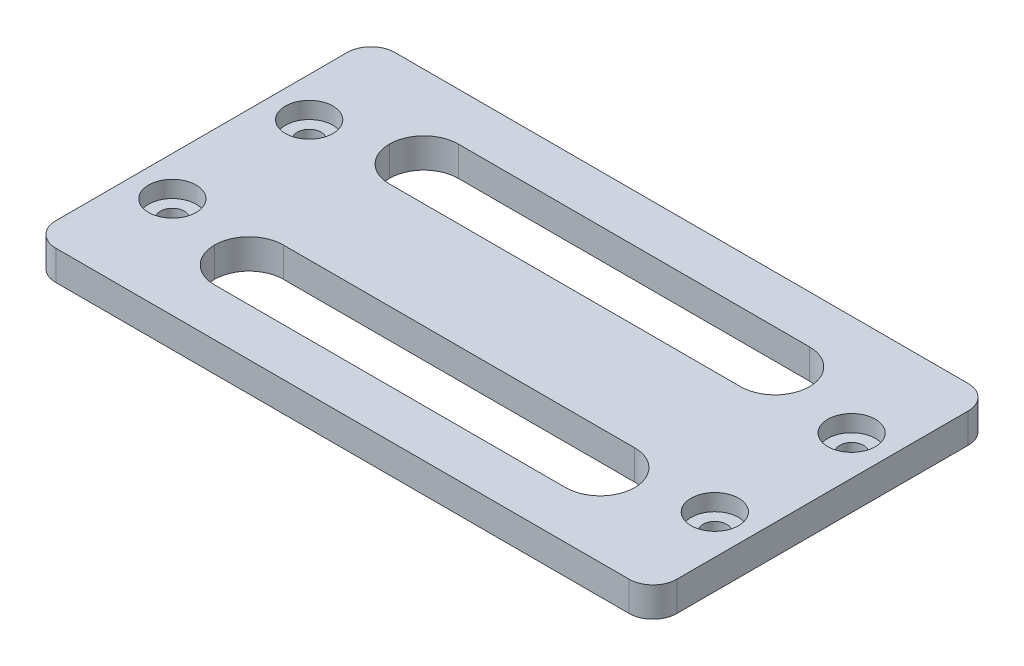
ISO-10303-21;
HEADER;
FILE_DESCRIPTION(('STEP AP214'),'2;1');
FILE_NAME('part.step','',(''),(''),'','','');
FILE_SCHEMA(('AUTOMOTIVE_DESIGN { 1 0 10303 214 1 1 1 1 }'));
ENDSEC;
DATA;
#1=APPLICATION_CONTEXT('core data for automotive mechanical design processes');
#2=APPLICATION_PROTOCOL_DEFINITION('international standard','automotive_design',2000,#1);
#3=PRODUCT_CONTEXT('',#1,'mechanical');
#4=PRODUCT('Part','Part','',(#3));
#5=PRODUCT_RELATED_PRODUCT_CATEGORY('part','',(#4));
#6=PRODUCT_DEFINITION_FORMATION('','',#4);
#7=PRODUCT_DEFINITION_CONTEXT('part definition',#1,'design');
#8=PRODUCT_DEFINITION('design','',#6,#7);
#9=PRODUCT_DEFINITION_SHAPE('','',#8);
#10=(LENGTH_UNIT() NAMED_UNIT(*) SI_UNIT(.MILLI.,.METRE.));
#11=(NAMED_UNIT(*) PLANE_ANGLE_UNIT() SI_UNIT($,.RADIAN.));
#12=(NAMED_UNIT(*) SI_UNIT($,.STERADIAN.) SOLID_ANGLE_UNIT());
#13=UNCERTAINTY_MEASURE_WITH_UNIT(LENGTH_MEASURE(1.E-05),#10,'distance_accuracy_value','');
#14=(GEOMETRIC_REPRESENTATION_CONTEXT(3) GLOBAL_UNCERTAINTY_ASSIGNED_CONTEXT((#13)) GLOBAL_UNIT_ASSIGNED_CONTEXT((#10,
#11,#12)) REPRESENTATION_CONTEXT('',''));
#15=CARTESIAN_POINT('',(0.,0.,0.));
#16=DIRECTION('',(0.,0.,1.));
#17=DIRECTION('',(1.,0.,0.));
#18=AXIS2_PLACEMENT_3D('',#15,#16,#17);
#19=CARTESIAN_POINT('',(22.8,2.5,-8.3));
#20=DIRECTION('',(0.,-1.,0.));
#21=DIRECTION('',(0.,0.,-1.));
#22=AXIS2_PLACEMENT_3D('',#19,#20,#21);
#23=CYLINDRICAL_SURFACE('',#22,1.);
#24=CARTESIAN_POINT('',(22.8,0.,-8.3));
#25=DIRECTION('',(0.,1.,0.));
#26=DIRECTION('',(0.,0.,1.));
#27=AXIS2_PLACEMENT_3D('',#24,#25,#26);
#28=CIRCLE('',#27,1.);
#29=CARTESIAN_POINT('',(22.8,0.,-7.29999999999999));
#30=VERTEX_POINT('',#29);
#31=EDGE_CURVE('E358',#30,#30,#28,.T.);
#32=ORIENTED_EDGE('',*,*,#31,.F.);
#33=EDGE_LOOP('',(#32));
#34=FACE_BOUND('',#33,.T.);
#35=CARTESIAN_POINT('',(22.8,1.1,-8.3));
#36=DIRECTION('',(0.,1.,0.));
#37=DIRECTION('',(0.,0.,1.));
#38=AXIS2_PLACEMENT_3D('',#35,#36,#37);
#39=CIRCLE('',#38,1.);
#40=CARTESIAN_POINT('',(22.8,1.1,-7.29999999999999));
#41=VERTEX_POINT('',#40);
#42=EDGE_CURVE('E38',#41,#41,#39,.T.);
#43=ORIENTED_EDGE('',*,*,#42,.T.);
#44=EDGE_LOOP('',(#43));
#45=FACE_BOUND('',#44,.T.);
#46=ADVANCED_FACE('F34',(#34,#45),#23,.F.);
#47=CARTESIAN_POINT('',(22.8,2.5,3.2));
#48=DIRECTION('',(0.,-1.,0.));
#49=DIRECTION('',(0.,0.,-1.));
#50=AXIS2_PLACEMENT_3D('',#47,#48,#49);
#51=CYLINDRICAL_SURFACE('',#50,1.);
#52=CARTESIAN_POINT('',(22.8,0.,3.2));
#53=DIRECTION('',(0.,1.,0.));
#54=DIRECTION('',(0.,0.,-1.));
#55=AXIS2_PLACEMENT_3D('',#52,#53,#54);
#56=CIRCLE('',#55,1.);
#57=CARTESIAN_POINT('',(22.8,0.,2.19999999999999));
#58=VERTEX_POINT('',#57);
#59=EDGE_CURVE('E361',#58,#58,#56,.T.);
#60=ORIENTED_EDGE('',*,*,#59,.F.);
#61=EDGE_LOOP('',(#60));
#62=FACE_BOUND('',#61,.T.);
#63=CARTESIAN_POINT('',(22.8,1.1,3.2));
#64=DIRECTION('',(0.,1.,0.));
#65=DIRECTION('',(0.,0.,1.));
#66=AXIS2_PLACEMENT_3D('',#63,#64,#65);
#67=CIRCLE('',#66,1.);
#68=CARTESIAN_POINT('',(22.8,1.1,4.2));
#69=VERTEX_POINT('',#68);
#70=EDGE_CURVE('E308',#69,#69,#67,.T.);
#71=ORIENTED_EDGE('',*,*,#70,.T.);
#72=EDGE_LOOP('',(#71));
#73=FACE_BOUND('',#72,.T.);
#74=ADVANCED_FACE('F412',(#62,#73),#51,.F.);
#75=CARTESIAN_POINT('',(-22.8,2.5,3.2));
#76=DIRECTION('',(0.,-1.,0.));
#77=DIRECTION('',(0.,0.,-1.));
#78=AXIS2_PLACEMENT_3D('',#75,#76,#77);
#79=CYLINDRICAL_SURFACE('',#78,1.);
#80=CARTESIAN_POINT('',(-22.8,0.,3.2));
#81=DIRECTION('',(0.,1.,0.));
#82=DIRECTION('',(0.,0.,1.));
#83=AXIS2_PLACEMENT_3D('',#80,#81,#82);
#84=CIRCLE('',#83,1.);
#85=CARTESIAN_POINT('',(-22.8,0.,4.2));
#86=VERTEX_POINT('',#85);
#87=EDGE_CURVE('E205',#86,#86,#84,.T.);
#88=ORIENTED_EDGE('',*,*,#87,.F.);
#89=EDGE_LOOP('',(#88));
#90=FACE_BOUND('',#89,.T.);
#91=CARTESIAN_POINT('',(-22.8,1.1,3.2));
#92=DIRECTION('',(0.,1.,0.));
#93=DIRECTION('',(0.,0.,1.));
#94=AXIS2_PLACEMENT_3D('',#91,#92,#93);
#95=CIRCLE('',#94,1.);
#96=CARTESIAN_POINT('',(-22.8,1.1,4.2));
#97=VERTEX_POINT('',#96);
#98=EDGE_CURVE('E304',#97,#97,#95,.T.);
#99=ORIENTED_EDGE('',*,*,#98,.T.);
#100=EDGE_LOOP('',(#99));
#101=FACE_BOUND('',#100,.T.);
#102=ADVANCED_FACE('F418',(#90,#101),#79,.F.);
#103=CARTESIAN_POINT('',(-22.8,2.5,-8.29999999999999));
#104=DIRECTION('',(0.,-1.,0.));
#105=DIRECTION('',(0.,0.,-1.));
#106=AXIS2_PLACEMENT_3D('',#103,#104,#105);
#107=CYLINDRICAL_SURFACE('',#106,1.);
#108=CARTESIAN_POINT('',(-22.8,0.,-8.29999999999999));
#109=DIRECTION('',(0.,1.,0.));
#110=DIRECTION('',(0.,0.,-1.));
#111=AXIS2_PLACEMENT_3D('',#108,#109,#110);
#112=CIRCLE('',#111,1.);
#113=CARTESIAN_POINT('',(-22.8,0.,-9.29999999999999));
#114=VERTEX_POINT('',#113);
#115=EDGE_CURVE('E352',#114,#114,#112,.T.);
#116=ORIENTED_EDGE('',*,*,#115,.F.);
#117=EDGE_LOOP('',(#116));
#118=FACE_BOUND('',#117,.T.);
#119=CARTESIAN_POINT('',(-22.8,1.1,-8.29999999999999));
#120=DIRECTION('',(0.,1.,0.));
#121=DIRECTION('',(0.,0.,1.));
#122=AXIS2_PLACEMENT_3D('',#119,#120,#121);
#123=CIRCLE('',#122,1.);
#124=CARTESIAN_POINT('',(-22.8,1.1,-7.29999999999999));
#125=VERTEX_POINT('',#124);
#126=EDGE_CURVE('E300',#125,#125,#123,.T.);
#127=ORIENTED_EDGE('',*,*,#126,.T.);
#128=EDGE_LOOP('',(#127));
#129=FACE_BOUND('',#128,.T.);
#130=ADVANCED_FACE('F424',(#118,#129),#107,.F.);
#131=CARTESIAN_POINT('',(0.,2.5,0.));
#132=DIRECTION('',(0.,-1.,0.));
#133=DIRECTION('',(0.,0.,-1.));
#134=AXIS2_PLACEMENT_3D('',#131,#132,#133);
#135=PLANE('',#134);
#136=CARTESIAN_POINT('',(22.8,2.5,-8.3));
#137=DIRECTION('',(0.,1.,0.));
#138=DIRECTION('',(0.,0.,1.));
#139=AXIS2_PLACEMENT_3D('',#136,#137,#138);
#140=CIRCLE('',#139,2.);
#141=CARTESIAN_POINT('',(22.8,2.5,-6.29999999999999));
#142=VERTEX_POINT('',#141);
#143=EDGE_CURVE('E324',#142,#142,#140,.T.);
#144=ORIENTED_EDGE('',*,*,#143,.F.);
#145=EDGE_LOOP('',(#144));
#146=FACE_BOUND('',#145,.T.);
#147=CARTESIAN_POINT('',(22.8,2.5,3.2));
#148=DIRECTION('',(0.,1.,0.));
#149=DIRECTION('',(0.,0.,1.));
#150=AXIS2_PLACEMENT_3D('',#147,#148,#149);
#151=CIRCLE('',#150,2.);
#152=CARTESIAN_POINT('',(22.8,2.5,5.2));
#153=VERTEX_POINT('',#152);
#154=EDGE_CURVE('E317',#153,#153,#151,.T.);
#155=ORIENTED_EDGE('',*,*,#154,.F.);
#156=EDGE_LOOP('',(#155));
#157=FACE_BOUND('',#156,.T.);
#158=CARTESIAN_POINT('',(-22.8,2.5,3.2));
#159=DIRECTION('',(0.,1.,0.));
#160=DIRECTION('',(0.,0.,1.));
#161=AXIS2_PLACEMENT_3D('',#158,#159,#160);
#162=CIRCLE('',#161,2.);
#163=CARTESIAN_POINT('',(-22.8,2.5,5.2));
#164=VERTEX_POINT('',#163);
#165=EDGE_CURVE('E310',#164,#164,#162,.T.);
#166=ORIENTED_EDGE('',*,*,#165,.F.);
#167=EDGE_LOOP('',(#166));
#168=FACE_BOUND('',#167,.T.);
#169=CARTESIAN_POINT('',(-22.8,2.5,-8.29999999999999));
#170=DIRECTION('',(0.,1.,0.));
#171=DIRECTION('',(0.,0.,1.));
#172=AXIS2_PLACEMENT_3D('',#169,#170,#171);
#173=CIRCLE('',#172,2.);
#174=CARTESIAN_POINT('',(-22.8,2.5,-6.29999999999999));
#175=VERTEX_POINT('',#174);
#176=EDGE_CURVE('E306',#175,#175,#173,.T.);
#177=ORIENTED_EDGE('',*,*,#176,.F.);
#178=EDGE_LOOP('',(#177));
#179=FACE_BOUND('',#178,.T.);
#180=DIRECTION('',(-1.,0.,0.));
#181=VECTOR('',#180,1.);
#182=CARTESIAN_POINT('',(-17.6603184164153,2.5,-12.8));
#183=LINE('',#182,#181);
#184=CARTESIAN_POINT('',(14.7603184164153,2.5,-12.8));
#185=VERTEX_POINT('',#184);
#186=CARTESIAN_POINT('',(-14.7603184164153,2.5,-12.8));
#187=VERTEX_POINT('',#186);
#188=EDGE_CURVE('E345',#185,#187,#183,.T.);
#189=ORIENTED_EDGE('',*,*,#188,.F.);
#190=CARTESIAN_POINT('',(14.7603184164153,2.5,-9.90000000000001));
#191=DIRECTION('',(0.,-1.,0.));
#192=DIRECTION('',(0.,0.,-1.));
#193=AXIS2_PLACEMENT_3D('',#190,#191,#192);
#194=CIRCLE('',#193,2.9);
#195=CARTESIAN_POINT('',(17.6603184164153,2.5,-9.90000000000001));
#196=VERTEX_POINT('',#195);
#197=EDGE_CURVE('E265',#185,#196,#194,.T.);
#198=ORIENTED_EDGE('',*,*,#197,.T.);
#199=CARTESIAN_POINT('',(14.7603184164153,2.5,-9.90000000000001));
#200=DIRECTION('',(0.,-1.,0.));
#201=DIRECTION('',(0.,0.,-1.));
#202=AXIS2_PLACEMENT_3D('',#199,#200,#201);
#203=CIRCLE('',#202,2.9);
#204=CARTESIAN_POINT('',(14.7603184164153,2.5,-7.00000000000001));
#205=VERTEX_POINT('',#204);
#206=EDGE_CURVE('E261',#196,#205,#203,.T.);
#207=ORIENTED_EDGE('',*,*,#206,.T.);
#208=DIRECTION('',(1.,0.,0.));
#209=VECTOR('',#208,1.);
#210=CARTESIAN_POINT('',(-17.6603184164153,2.5,-7.00000000000001));
#211=LINE('',#210,#209);
#212=CARTESIAN_POINT('',(-14.7603184164153,2.5,-7.00000000000001));
#213=VERTEX_POINT('',#212);
#214=EDGE_CURVE('E348',#213,#205,#211,.T.);
#215=ORIENTED_EDGE('',*,*,#214,.F.);
#216=CARTESIAN_POINT('',(-14.7603184164153,2.5,-9.90000000000001));
#217=DIRECTION('',(0.,-1.,0.));
#218=DIRECTION('',(0.,0.,-1.));
#219=AXIS2_PLACEMENT_3D('',#216,#217,#218);
#220=CIRCLE('',#219,2.9);
#221=CARTESIAN_POINT('',(-17.6603184164153,2.5,-9.90000000000001));
#222=VERTEX_POINT('',#221);
#223=EDGE_CURVE('E50',#213,#222,#220,.T.);
#224=ORIENTED_EDGE('',*,*,#223,.T.);
#225=CARTESIAN_POINT('',(-14.7603184164153,2.5,-9.90000000000001));
#226=DIRECTION('',(0.,-1.,0.));
#227=DIRECTION('',(0.,0.,-1.));
#228=AXIS2_PLACEMENT_3D('',#225,#226,#227);
#229=CIRCLE('',#228,2.9);
#230=EDGE_CURVE('E11',#222,#187,#229,.T.);
#231=ORIENTED_EDGE('',*,*,#230,.T.);
#232=EDGE_LOOP('',(#189,#198,#207,#215,#224,#231));
#233=FACE_BOUND('',#232,.T.);
#234=DIRECTION('',(0.,0.,-1.));
#235=VECTOR('',#234,1.);
#236=CARTESIAN_POINT('',(26.1,2.5,11.7));
#237=LINE('',#236,#235);
#238=CARTESIAN_POINT('',(26.1,2.5,9.7));
#239=VERTEX_POINT('',#238);
#240=CARTESIAN_POINT('',(26.1,2.5,-14.8));
#241=VERTEX_POINT('',#240);
#242=EDGE_CURVE('E211',#239,#241,#237,.T.);
#243=ORIENTED_EDGE('',*,*,#242,.T.);
#244=CARTESIAN_POINT('',(24.1,2.5,-14.8));
#245=DIRECTION('',(0.,-1.,0.));
#246=DIRECTION('',(0.,0.,-1.));
#247=AXIS2_PLACEMENT_3D('',#244,#245,#246);
#248=CIRCLE('',#247,2.);
#249=CARTESIAN_POINT('',(24.1,2.5,-16.8));
#250=VERTEX_POINT('',#249);
#251=EDGE_CURVE('E227',#241,#250,#248,.F.);
#252=ORIENTED_EDGE('',*,*,#251,.T.);
#253=DIRECTION('',(-1.,0.,0.));
#254=VECTOR('',#253,1.);
#255=CARTESIAN_POINT('',(-26.1,2.5,-16.8));
#256=LINE('',#255,#254);
#257=CARTESIAN_POINT('',(-24.1,2.5,-16.8));
#258=VERTEX_POINT('',#257);
#259=EDGE_CURVE('E192',#250,#258,#256,.T.);
#260=ORIENTED_EDGE('',*,*,#259,.T.);
#261=CARTESIAN_POINT('',(-24.1,2.5,-14.8));
#262=DIRECTION('',(0.,-1.,0.));
#263=DIRECTION('',(0.,0.,-1.));
#264=AXIS2_PLACEMENT_3D('',#261,#262,#263);
#265=CIRCLE('',#264,2.);
#266=CARTESIAN_POINT('',(-26.1,2.5,-14.8));
#267=VERTEX_POINT('',#266);
#268=EDGE_CURVE('E221',#258,#267,#265,.F.);
#269=ORIENTED_EDGE('',*,*,#268,.T.);
#270=DIRECTION('',(0.,0.,1.));
#271=VECTOR('',#270,1.);
#272=CARTESIAN_POINT('',(-26.1,2.5,11.7));
#273=LINE('',#272,#271);
#274=CARTESIAN_POINT('',(-26.1,2.5,9.7));
#275=VERTEX_POINT('',#274);
#276=EDGE_CURVE('E369',#267,#275,#273,.T.);
#277=ORIENTED_EDGE('',*,*,#276,.T.);
#278=CARTESIAN_POINT('',(-24.1,2.5,9.7));
#279=DIRECTION('',(0.,-1.,0.));
#280=DIRECTION('',(0.,0.,-1.));
#281=AXIS2_PLACEMENT_3D('',#278,#279,#280);
#282=CIRCLE('',#281,2.);
#283=CARTESIAN_POINT('',(-24.1,2.5,11.7));
#284=VERTEX_POINT('',#283);
#285=EDGE_CURVE('E223',#275,#284,#282,.F.);
#286=ORIENTED_EDGE('',*,*,#285,.T.);
#287=DIRECTION('',(1.,0.,0.));
#288=VECTOR('',#287,1.);
#289=CARTESIAN_POINT('',(-26.1,2.5,11.7));
#290=LINE('',#289,#288);
#291=CARTESIAN_POINT('',(24.1,2.5,11.7));
#292=VERTEX_POINT('',#291);
#293=EDGE_CURVE('E212',#284,#292,#290,.T.);
#294=ORIENTED_EDGE('',*,*,#293,.T.);
#295=CARTESIAN_POINT('',(24.1,2.5,9.7));
#296=DIRECTION('',(0.,-1.,0.));
#297=DIRECTION('',(0.,0.,-1.));
#298=AXIS2_PLACEMENT_3D('',#295,#296,#297);
#299=CIRCLE('',#298,2.);
#300=EDGE_CURVE('E225',#292,#239,#299,.F.);
#301=ORIENTED_EDGE('',*,*,#300,.T.);
#302=EDGE_LOOP('',(#243,#252,#260,#269,#277,#286,#294,#301));
#303=FACE_BOUND('',#302,.T.);
#304=CARTESIAN_POINT('',(-14.7603184164153,2.5,4.80000000000001));
#305=DIRECTION('',(0.,-1.,0.));
#306=DIRECTION('',(0.,0.,-1.));
#307=AXIS2_PLACEMENT_3D('',#304,#305,#306);
#308=CIRCLE('',#307,2.9);
#309=CARTESIAN_POINT('',(-14.7603184164153,2.5,7.70000000000001));
#310=VERTEX_POINT('',#309);
#311=CARTESIAN_POINT('',(-17.6603184164153,2.5,4.80000000000001));
#312=VERTEX_POINT('',#311);
#313=EDGE_CURVE('E277',#310,#312,#308,.T.);
#314=ORIENTED_EDGE('',*,*,#313,.T.);
#315=CARTESIAN_POINT('',(-14.7603184164153,2.5,4.80000000000001));
#316=DIRECTION('',(0.,-1.,0.));
#317=DIRECTION('',(0.,0.,-1.));
#318=AXIS2_PLACEMENT_3D('',#315,#316,#317);
#319=CIRCLE('',#318,2.9);
#320=CARTESIAN_POINT('',(-14.7603184164153,2.5,1.90000000000001));
#321=VERTEX_POINT('',#320);
#322=EDGE_CURVE('E281',#312,#321,#319,.T.);
#323=ORIENTED_EDGE('',*,*,#322,.T.);
#324=DIRECTION('',(-1.,0.,0.));
#325=VECTOR('',#324,1.);
#326=CARTESIAN_POINT('',(-17.6603184164153,2.5,1.90000000000001));
#327=LINE('',#326,#325);
#328=CARTESIAN_POINT('',(14.7603184164153,2.5,1.90000000000001));
#329=VERTEX_POINT('',#328);
#330=EDGE_CURVE('E336',#329,#321,#327,.T.);
#331=ORIENTED_EDGE('',*,*,#330,.F.);
#332=CARTESIAN_POINT('',(14.7603184164153,2.5,4.80000000000001));
#333=DIRECTION('',(0.,-1.,0.));
#334=DIRECTION('',(0.,0.,-1.));
#335=AXIS2_PLACEMENT_3D('',#332,#333,#334);
#336=CIRCLE('',#335,2.9);
#337=CARTESIAN_POINT('',(17.6603184164153,2.5,4.80000000000001));
#338=VERTEX_POINT('',#337);
#339=EDGE_CURVE('E273',#329,#338,#336,.T.);
#340=ORIENTED_EDGE('',*,*,#339,.T.);
#341=CARTESIAN_POINT('',(14.7603184164153,2.5,4.80000000000001));
#342=DIRECTION('',(0.,-1.,0.));
#343=DIRECTION('',(0.,0.,-1.));
#344=AXIS2_PLACEMENT_3D('',#341,#342,#343);
#345=CIRCLE('',#344,2.9);
#346=CARTESIAN_POINT('',(14.7603184164153,2.5,7.70000000000001));
#347=VERTEX_POINT('',#346);
#348=EDGE_CURVE('E269',#338,#347,#345,.T.);
#349=ORIENTED_EDGE('',*,*,#348,.T.);
#350=DIRECTION('',(1.,0.,0.));
#351=VECTOR('',#350,1.);
#352=CARTESIAN_POINT('',(-17.6603184164153,2.5,7.70000000000001));
#353=LINE('',#352,#351);
#354=EDGE_CURVE('E333',#310,#347,#353,.T.);
#355=ORIENTED_EDGE('',*,*,#354,.F.);
#356=EDGE_LOOP('',(#314,#323,#331,#340,#349,#355));
#357=FACE_BOUND('',#356,.T.);
#358=ADVANCED_FACE('F375',(#146,#157,#168,#179,#233,#303,#357),#135,.F.);
#359=CARTESIAN_POINT('',(0.,0.,0.));
#360=DIRECTION('',(0.,-1.,0.));
#361=DIRECTION('',(0.,0.,-1.));
#362=AXIS2_PLACEMENT_3D('',#359,#360,#361);
#363=PLANE('',#362);
#364=DIRECTION('',(-1.,0.,0.));
#365=VECTOR('',#364,1.);
#366=CARTESIAN_POINT('',(-17.6603184164153,0.,-12.8));
#367=LINE('',#366,#365);
#368=CARTESIAN_POINT('',(14.7603184164153,0.,-12.8));
#369=VERTEX_POINT('',#368);
#370=CARTESIAN_POINT('',(-14.7603184164153,0.,-12.8));
#371=VERTEX_POINT('',#370);
#372=EDGE_CURVE('E340',#369,#371,#367,.T.);
#373=ORIENTED_EDGE('',*,*,#372,.T.);
#374=CARTESIAN_POINT('',(-14.7603184164153,0.,-9.90000000000001));
#375=DIRECTION('',(0.,-1.,0.));
#376=DIRECTION('',(0.,0.,-1.));
#377=AXIS2_PLACEMENT_3D('',#374,#375,#376);
#378=CIRCLE('',#377,2.9);
#379=CARTESIAN_POINT('',(-17.6603184164153,0.,-9.90000000000001));
#380=VERTEX_POINT('',#379);
#381=EDGE_CURVE('E43',#371,#380,#378,.F.);
#382=ORIENTED_EDGE('',*,*,#381,.T.);
#383=CARTESIAN_POINT('',(-14.7603184164153,0.,-9.90000000000001));
#384=DIRECTION('',(0.,-1.,0.));
#385=DIRECTION('',(0.,0.,-1.));
#386=AXIS2_PLACEMENT_3D('',#383,#384,#385);
#387=CIRCLE('',#386,2.9);
#388=CARTESIAN_POINT('',(-14.7603184164153,0.,-7.00000000000001));
#389=VERTEX_POINT('',#388);
#390=EDGE_CURVE('E283',#380,#389,#387,.F.);
#391=ORIENTED_EDGE('',*,*,#390,.T.);
#392=DIRECTION('',(1.,0.,0.));
#393=VECTOR('',#392,1.);
#394=CARTESIAN_POINT('',(-17.6603184164153,0.,-7.00000000000001));
#395=LINE('',#394,#393);
#396=CARTESIAN_POINT('',(14.7603184164153,0.,-7.00000000000001));
#397=VERTEX_POINT('',#396);
#398=EDGE_CURVE('E349',#389,#397,#395,.T.);
#399=ORIENTED_EDGE('',*,*,#398,.T.);
#400=CARTESIAN_POINT('',(14.7603184164153,0.,-9.90000000000001));
#401=DIRECTION('',(0.,-1.,0.));
#402=DIRECTION('',(0.,0.,-1.));
#403=AXIS2_PLACEMENT_3D('',#400,#401,#402);
#404=CIRCLE('',#403,2.9);
#405=CARTESIAN_POINT('',(17.6603184164153,0.,-9.90000000000001));
#406=VERTEX_POINT('',#405);
#407=EDGE_CURVE('E259',#397,#406,#404,.F.);
#408=ORIENTED_EDGE('',*,*,#407,.T.);
#409=CARTESIAN_POINT('',(14.7603184164153,0.,-9.90000000000001));
#410=DIRECTION('',(0.,-1.,0.));
#411=DIRECTION('',(0.,0.,-1.));
#412=AXIS2_PLACEMENT_3D('',#409,#410,#411);
#413=CIRCLE('',#412,2.9);
#414=EDGE_CURVE('E263',#406,#369,#413,.F.);
#415=ORIENTED_EDGE('',*,*,#414,.T.);
#416=EDGE_LOOP('',(#373,#382,#391,#399,#408,#415));
#417=FACE_BOUND('',#416,.T.);
#418=ORIENTED_EDGE('',*,*,#31,.T.);
#419=EDGE_LOOP('',(#418));
#420=FACE_BOUND('',#419,.T.);
#421=ORIENTED_EDGE('',*,*,#87,.T.);
#422=EDGE_LOOP('',(#421));
#423=FACE_BOUND('',#422,.T.);
#424=DIRECTION('',(-1.,0.,0.));
#425=VECTOR('',#424,1.);
#426=CARTESIAN_POINT('',(-26.1,0.,-16.8));
#427=LINE('',#426,#425);
#428=CARTESIAN_POINT('',(24.1,0.,-16.8));
#429=VERTEX_POINT('',#428);
#430=CARTESIAN_POINT('',(-24.1,0.,-16.8));
#431=VERTEX_POINT('',#430);
#432=EDGE_CURVE('E189',#429,#431,#427,.T.);
#433=ORIENTED_EDGE('',*,*,#432,.F.);
#434=CARTESIAN_POINT('',(24.1,0.,-14.8));
#435=DIRECTION('',(0.,-1.,0.));
#436=DIRECTION('',(0.,0.,-1.));
#437=AXIS2_PLACEMENT_3D('',#434,#435,#436);
#438=CIRCLE('',#437,2.);
#439=CARTESIAN_POINT('',(26.1,0.,-14.8));
#440=VERTEX_POINT('',#439);
#441=EDGE_CURVE('E172',#429,#440,#438,.T.);
#442=ORIENTED_EDGE('',*,*,#441,.T.);
#443=DIRECTION('',(0.,0.,-1.));
#444=VECTOR('',#443,1.);
#445=CARTESIAN_POINT('',(26.1,0.,11.7));
#446=LINE('',#445,#444);
#447=CARTESIAN_POINT('',(26.1,0.,9.7));
#448=VERTEX_POINT('',#447);
#449=EDGE_CURVE('E200',#448,#440,#446,.T.);
#450=ORIENTED_EDGE('',*,*,#449,.F.);
#451=CARTESIAN_POINT('',(24.1,0.,9.7));
#452=DIRECTION('',(0.,-1.,0.));
#453=DIRECTION('',(0.,0.,-1.));
#454=AXIS2_PLACEMENT_3D('',#451,#452,#453);
#455=CIRCLE('',#454,2.);
#456=CARTESIAN_POINT('',(24.1,0.,11.7));
#457=VERTEX_POINT('',#456);
#458=EDGE_CURVE('E183',#448,#457,#455,.T.);
#459=ORIENTED_EDGE('',*,*,#458,.T.);
#460=DIRECTION('',(1.,0.,0.));
#461=VECTOR('',#460,1.);
#462=CARTESIAN_POINT('',(-26.1,0.,11.7));
#463=LINE('',#462,#461);
#464=CARTESIAN_POINT('',(-24.1,0.,11.7));
#465=VERTEX_POINT('',#464);
#466=EDGE_CURVE('E203',#465,#457,#463,.T.);
#467=ORIENTED_EDGE('',*,*,#466,.F.);
#468=CARTESIAN_POINT('',(-24.1,0.,9.7));
#469=DIRECTION('',(0.,-1.,0.));
#470=DIRECTION('',(0.,0.,-1.));
#471=AXIS2_PLACEMENT_3D('',#468,#469,#470);
#472=CIRCLE('',#471,2.);
#473=CARTESIAN_POINT('',(-26.1,0.,9.7));
#474=VERTEX_POINT('',#473);
#475=EDGE_CURVE('E215',#465,#474,#472,.T.);
#476=ORIENTED_EDGE('',*,*,#475,.T.);
#477=DIRECTION('',(0.,0.,1.));
#478=VECTOR('',#477,1.);
#479=CARTESIAN_POINT('',(-26.1,0.,11.7));
#480=LINE('',#479,#478);
#481=CARTESIAN_POINT('',(-26.1,0.,-14.8));
#482=VERTEX_POINT('',#481);
#483=EDGE_CURVE('E199',#482,#474,#480,.T.);
#484=ORIENTED_EDGE('',*,*,#483,.F.);
#485=CARTESIAN_POINT('',(-24.1,0.,-14.8));
#486=DIRECTION('',(0.,-1.,0.));
#487=DIRECTION('',(0.,0.,-1.));
#488=AXIS2_PLACEMENT_3D('',#485,#486,#487);
#489=CIRCLE('',#488,2.);
#490=EDGE_CURVE('E193',#482,#431,#489,.T.);
#491=ORIENTED_EDGE('',*,*,#490,.T.);
#492=EDGE_LOOP('',(#433,#442,#450,#459,#467,#476,#484,#491));
#493=FACE_BOUND('',#492,.T.);
#494=ORIENTED_EDGE('',*,*,#59,.T.);
#495=EDGE_LOOP('',(#494));
#496=FACE_BOUND('',#495,.T.);
#497=ORIENTED_EDGE('',*,*,#115,.T.);
#498=EDGE_LOOP('',(#497));
#499=FACE_BOUND('',#498,.T.);
#500=CARTESIAN_POINT('',(14.7603184164153,0.,4.80000000000001));
#501=DIRECTION('',(0.,-1.,0.));
#502=DIRECTION('',(0.,0.,-1.));
#503=AXIS2_PLACEMENT_3D('',#500,#501,#502);
#504=CIRCLE('',#503,2.9);
#505=CARTESIAN_POINT('',(14.7603184164153,0.,7.70000000000001));
#506=VERTEX_POINT('',#505);
#507=CARTESIAN_POINT('',(17.6603184164153,0.,4.80000000000001));
#508=VERTEX_POINT('',#507);
#509=EDGE_CURVE('E267',#506,#508,#504,.F.);
#510=ORIENTED_EDGE('',*,*,#509,.T.);
#511=CARTESIAN_POINT('',(14.7603184164153,0.,4.80000000000001));
#512=DIRECTION('',(0.,-1.,0.));
#513=DIRECTION('',(0.,0.,-1.));
#514=AXIS2_PLACEMENT_3D('',#511,#512,#513);
#515=CIRCLE('',#514,2.9);
#516=CARTESIAN_POINT('',(14.7603184164153,0.,1.90000000000001));
#517=VERTEX_POINT('',#516);
#518=EDGE_CURVE('E271',#508,#517,#515,.F.);
#519=ORIENTED_EDGE('',*,*,#518,.T.);
#520=DIRECTION('',(-1.,0.,0.));
#521=VECTOR('',#520,1.);
#522=CARTESIAN_POINT('',(-17.6603184164153,0.,1.90000000000001));
#523=LINE('',#522,#521);
#524=CARTESIAN_POINT('',(-14.7603184164153,0.,1.90000000000001));
#525=VERTEX_POINT('',#524);
#526=EDGE_CURVE('E337',#517,#525,#523,.T.);
#527=ORIENTED_EDGE('',*,*,#526,.T.);
#528=CARTESIAN_POINT('',(-14.7603184164153,0.,4.80000000000001));
#529=DIRECTION('',(0.,-1.,0.));
#530=DIRECTION('',(0.,0.,-1.));
#531=AXIS2_PLACEMENT_3D('',#528,#529,#530);
#532=CIRCLE('',#531,2.9);
#533=CARTESIAN_POINT('',(-17.6603184164153,0.,4.80000000000001));
#534=VERTEX_POINT('',#533);
#535=EDGE_CURVE('E279',#525,#534,#532,.F.);
#536=ORIENTED_EDGE('',*,*,#535,.T.);
#537=CARTESIAN_POINT('',(-14.7603184164153,0.,4.80000000000001));
#538=DIRECTION('',(0.,-1.,0.));
#539=DIRECTION('',(0.,0.,-1.));
#540=AXIS2_PLACEMENT_3D('',#537,#538,#539);
#541=CIRCLE('',#540,2.9);
#542=CARTESIAN_POINT('',(-14.7603184164153,0.,7.70000000000001));
#543=VERTEX_POINT('',#542);
#544=EDGE_CURVE('E275',#534,#543,#541,.F.);
#545=ORIENTED_EDGE('',*,*,#544,.T.);
#546=DIRECTION('',(1.,0.,0.));
#547=VECTOR('',#546,1.);
#548=CARTESIAN_POINT('',(-17.6603184164153,0.,7.70000000000001));
#549=LINE('',#548,#547);
#550=EDGE_CURVE('E290',#543,#506,#549,.T.);
#551=ORIENTED_EDGE('',*,*,#550,.T.);
#552=EDGE_LOOP('',(#510,#519,#527,#536,#545,#551));
#553=FACE_BOUND('',#552,.T.);
#554=ADVANCED_FACE('F196',(#417,#420,#423,#493,#496,#499,#553),#363,.T.);
#555=CARTESIAN_POINT('',(26.1,2.5,11.7));
#556=DIRECTION('',(-1.,0.,0.));
#557=DIRECTION('',(0.,0.,1.));
#558=AXIS2_PLACEMENT_3D('',#555,#556,#557);
#559=PLANE('',#558);
#560=ORIENTED_EDGE('',*,*,#449,.T.);
#561=DIRECTION('',(0.,-1.,0.));
#562=VECTOR('',#561,1.);
#563=CARTESIAN_POINT('',(26.1,2.5,-14.8));
#564=LINE('',#563,#562);
#565=EDGE_CURVE('E177',#440,#241,#564,.F.);
#566=ORIENTED_EDGE('',*,*,#565,.T.);
#567=ORIENTED_EDGE('',*,*,#242,.F.);
#568=DIRECTION('',(0.,-1.,0.));
#569=VECTOR('',#568,1.);
#570=CARTESIAN_POINT('',(26.1,2.5,9.7));
#571=LINE('',#570,#569);
#572=EDGE_CURVE('E182',#239,#448,#571,.T.);
#573=ORIENTED_EDGE('',*,*,#572,.T.);
#574=EDGE_LOOP('',(#560,#566,#567,#573));
#575=FACE_BOUND('',#574,.T.);
#576=ADVANCED_FACE('F386',(#575),#559,.F.);
#577=CARTESIAN_POINT('',(-26.1,2.5,-16.8));
#578=DIRECTION('',(0.,0.,1.));
#579=DIRECTION('',(1.,0.,0.));
#580=AXIS2_PLACEMENT_3D('',#577,#578,#579);
#581=PLANE('',#580);
#582=ORIENTED_EDGE('',*,*,#259,.F.);
#583=DIRECTION('',(0.,-1.,0.));
#584=VECTOR('',#583,1.);
#585=CARTESIAN_POINT('',(24.1,2.5,-16.8));
#586=LINE('',#585,#584);
#587=EDGE_CURVE('E176',#250,#429,#586,.T.);
#588=ORIENTED_EDGE('',*,*,#587,.T.);
#589=ORIENTED_EDGE('',*,*,#432,.T.);
#590=DIRECTION('',(0.,-1.,0.));
#591=VECTOR('',#590,1.);
#592=CARTESIAN_POINT('',(-24.1,2.5,-16.8));
#593=LINE('',#592,#591);
#594=EDGE_CURVE('E194',#431,#258,#593,.F.);
#595=ORIENTED_EDGE('',*,*,#594,.T.);
#596=EDGE_LOOP('',(#582,#588,#589,#595));
#597=FACE_BOUND('',#596,.T.);
#598=ADVANCED_FACE('F188',(#597),#581,.F.);
#599=CARTESIAN_POINT('',(-26.1,2.5,11.7));
#600=DIRECTION('',(1.,0.,0.));
#601=DIRECTION('',(0.,0.,-1.));
#602=AXIS2_PLACEMENT_3D('',#599,#600,#601);
#603=PLANE('',#602);
#604=ORIENTED_EDGE('',*,*,#483,.T.);
#605=DIRECTION('',(0.,-1.,0.));
#606=VECTOR('',#605,1.);
#607=CARTESIAN_POINT('',(-26.1,2.5,9.7));
#608=LINE('',#607,#606);
#609=EDGE_CURVE('E237',#474,#275,#608,.F.);
#610=ORIENTED_EDGE('',*,*,#609,.T.);
#611=ORIENTED_EDGE('',*,*,#276,.F.);
#612=DIRECTION('',(0.,-1.,0.));
#613=VECTOR('',#612,1.);
#614=CARTESIAN_POINT('',(-26.1,2.5,-14.8));
#615=LINE('',#614,#613);
#616=EDGE_CURVE('E234',#267,#482,#615,.T.);
#617=ORIENTED_EDGE('',*,*,#616,.T.);
#618=EDGE_LOOP('',(#604,#610,#611,#617));
#619=FACE_BOUND('',#618,.T.);
#620=ADVANCED_FACE('F393',(#619),#603,.F.);
#621=CARTESIAN_POINT('',(-26.1,2.5,11.7));
#622=DIRECTION('',(0.,0.,-1.));
#623=DIRECTION('',(-1.,0.,0.));
#624=AXIS2_PLACEMENT_3D('',#621,#622,#623);
#625=PLANE('',#624);
#626=ORIENTED_EDGE('',*,*,#466,.T.);
#627=DIRECTION('',(0.,-1.,0.));
#628=VECTOR('',#627,1.);
#629=CARTESIAN_POINT('',(24.1,2.5,11.7));
#630=LINE('',#629,#628);
#631=EDGE_CURVE('E232',#457,#292,#630,.F.);
#632=ORIENTED_EDGE('',*,*,#631,.T.);
#633=ORIENTED_EDGE('',*,*,#293,.F.);
#634=DIRECTION('',(0.,-1.,0.));
#635=VECTOR('',#634,1.);
#636=CARTESIAN_POINT('',(-24.1,2.5,11.7));
#637=LINE('',#636,#635);
#638=EDGE_CURVE('E229',#284,#465,#637,.T.);
#639=ORIENTED_EDGE('',*,*,#638,.T.);
#640=EDGE_LOOP('',(#626,#632,#633,#639));
#641=FACE_BOUND('',#640,.T.);
#642=ADVANCED_FACE('F388',(#641),#625,.F.);
#643=CARTESIAN_POINT('',(-17.6603184164153,2.5,-12.8));
#644=DIRECTION('',(0.,0.,1.));
#645=DIRECTION('',(1.,0.,0.));
#646=AXIS2_PLACEMENT_3D('',#643,#644,#645);
#647=PLANE('',#646);
#648=ORIENTED_EDGE('',*,*,#372,.F.);
#649=DIRECTION('',(0.,-1.,0.));
#650=VECTOR('',#649,1.);
#651=CARTESIAN_POINT('',(14.7603184164153,2.5,-12.8));
#652=LINE('',#651,#650);
#653=EDGE_CURVE('E247',#369,#185,#652,.F.);
#654=ORIENTED_EDGE('',*,*,#653,.T.);
#655=ORIENTED_EDGE('',*,*,#188,.T.);
#656=DIRECTION('',(0.,-1.,0.));
#657=VECTOR('',#656,1.);
#658=CARTESIAN_POINT('',(-14.7603184164153,0.,-12.8));
#659=LINE('',#658,#657);
#660=EDGE_CURVE('E245',#187,#371,#659,.T.);
#661=ORIENTED_EDGE('',*,*,#660,.T.);
#662=EDGE_LOOP('',(#648,#654,#655,#661));
#663=FACE_BOUND('',#662,.T.);
#664=ADVANCED_FACE('F437',(#663),#647,.T.);
#665=CARTESIAN_POINT('',(-17.6603184164153,2.5,-7.00000000000001));
#666=DIRECTION('',(0.,0.,-1.));
#667=DIRECTION('',(-1.,0.,0.));
#668=AXIS2_PLACEMENT_3D('',#665,#666,#667);
#669=PLANE('',#668);
#670=ORIENTED_EDGE('',*,*,#214,.T.);
#671=DIRECTION('',(0.,-1.,0.));
#672=VECTOR('',#671,1.);
#673=CARTESIAN_POINT('',(14.7603184164153,0.,-7.00000000000001));
#674=LINE('',#673,#672);
#675=EDGE_CURVE('E242',#205,#397,#674,.T.);
#676=ORIENTED_EDGE('',*,*,#675,.T.);
#677=ORIENTED_EDGE('',*,*,#398,.F.);
#678=DIRECTION('',(0.,-1.,0.));
#679=VECTOR('',#678,1.);
#680=CARTESIAN_POINT('',(-14.7603184164153,2.5,-7.00000000000001));
#681=LINE('',#680,#679);
#682=EDGE_CURVE('E239',#389,#213,#681,.F.);
#683=ORIENTED_EDGE('',*,*,#682,.T.);
#684=EDGE_LOOP('',(#670,#676,#677,#683));
#685=FACE_BOUND('',#684,.T.);
#686=ADVANCED_FACE('F479',(#685),#669,.T.);
#687=CARTESIAN_POINT('',(-17.6603184164153,2.5,7.70000000000001));
#688=DIRECTION('',(0.,0.,-1.));
#689=DIRECTION('',(-1.,0.,0.));
#690=AXIS2_PLACEMENT_3D('',#687,#688,#689);
#691=PLANE('',#690);
#692=ORIENTED_EDGE('',*,*,#354,.T.);
#693=DIRECTION('',(0.,-1.,0.));
#694=VECTOR('',#693,1.);
#695=CARTESIAN_POINT('',(14.7603184164153,0.,7.70000000000001));
#696=LINE('',#695,#694);
#697=EDGE_CURVE('E252',#347,#506,#696,.T.);
#698=ORIENTED_EDGE('',*,*,#697,.T.);
#699=ORIENTED_EDGE('',*,*,#550,.F.);
#700=DIRECTION('',(0.,-1.,0.));
#701=VECTOR('',#700,1.);
#702=CARTESIAN_POINT('',(-14.7603184164153,2.5,7.70000000000001));
#703=LINE('',#702,#701);
#704=EDGE_CURVE('E249',#543,#310,#703,.F.);
#705=ORIENTED_EDGE('',*,*,#704,.T.);
#706=EDGE_LOOP('',(#692,#698,#699,#705));
#707=FACE_BOUND('',#706,.T.);
#708=ADVANCED_FACE('F489',(#707),#691,.T.);
#709=CARTESIAN_POINT('',(-17.6603184164153,2.5,1.90000000000001));
#710=DIRECTION('',(0.,0.,1.));
#711=DIRECTION('',(1.,0.,0.));
#712=AXIS2_PLACEMENT_3D('',#709,#710,#711);
#713=PLANE('',#712);
#714=ORIENTED_EDGE('',*,*,#526,.F.);
#715=DIRECTION('',(0.,-1.,0.));
#716=VECTOR('',#715,1.);
#717=CARTESIAN_POINT('',(14.7603184164153,2.5,1.90000000000001));
#718=LINE('',#717,#716);
#719=EDGE_CURVE('E257',#517,#329,#718,.F.);
#720=ORIENTED_EDGE('',*,*,#719,.T.);
#721=ORIENTED_EDGE('',*,*,#330,.T.);
#722=DIRECTION('',(0.,-1.,0.));
#723=VECTOR('',#722,1.);
#724=CARTESIAN_POINT('',(-14.7603184164153,0.,1.90000000000001));
#725=LINE('',#724,#723);
#726=EDGE_CURVE('E255',#321,#525,#725,.T.);
#727=ORIENTED_EDGE('',*,*,#726,.T.);
#728=EDGE_LOOP('',(#714,#720,#721,#727));
#729=FACE_BOUND('',#728,.T.);
#730=ADVANCED_FACE('F446',(#729),#713,.T.);
#731=CARTESIAN_POINT('',(24.1,2.5,-14.8));
#732=DIRECTION('',(0.,-1.,0.));
#733=DIRECTION('',(0.,0.,-1.));
#734=AXIS2_PLACEMENT_3D('',#731,#732,#733);
#735=CYLINDRICAL_SURFACE('',#734,2.);
#736=ORIENTED_EDGE('',*,*,#251,.F.);
#737=ORIENTED_EDGE('',*,*,#565,.F.);
#738=ORIENTED_EDGE('',*,*,#441,.F.);
#739=ORIENTED_EDGE('',*,*,#587,.F.);
#740=EDGE_LOOP('',(#736,#737,#738,#739));
#741=FACE_BOUND('',#740,.T.);
#742=ADVANCED_FACE('F175',(#741),#735,.T.);
#743=CARTESIAN_POINT('',(24.1,2.5,9.7));
#744=DIRECTION('',(0.,-1.,0.));
#745=DIRECTION('',(0.,0.,-1.));
#746=AXIS2_PLACEMENT_3D('',#743,#744,#745);
#747=CYLINDRICAL_SURFACE('',#746,2.);
#748=ORIENTED_EDGE('',*,*,#300,.F.);
#749=ORIENTED_EDGE('',*,*,#631,.F.);
#750=ORIENTED_EDGE('',*,*,#458,.F.);
#751=ORIENTED_EDGE('',*,*,#572,.F.);
#752=EDGE_LOOP('',(#748,#749,#750,#751));
#753=FACE_BOUND('',#752,.T.);
#754=ADVANCED_FACE('F384',(#753),#747,.T.);
#755=CARTESIAN_POINT('',(-24.1,2.5,9.7));
#756=DIRECTION('',(0.,-1.,0.));
#757=DIRECTION('',(0.,0.,-1.));
#758=AXIS2_PLACEMENT_3D('',#755,#756,#757);
#759=CYLINDRICAL_SURFACE('',#758,2.);
#760=ORIENTED_EDGE('',*,*,#285,.F.);
#761=ORIENTED_EDGE('',*,*,#609,.F.);
#762=ORIENTED_EDGE('',*,*,#475,.F.);
#763=ORIENTED_EDGE('',*,*,#638,.F.);
#764=EDGE_LOOP('',(#760,#761,#762,#763));
#765=FACE_BOUND('',#764,.T.);
#766=ADVANCED_FACE('F390',(#765),#759,.T.);
#767=CARTESIAN_POINT('',(-24.1,2.5,-14.8));
#768=DIRECTION('',(0.,-1.,0.));
#769=DIRECTION('',(0.,0.,-1.));
#770=AXIS2_PLACEMENT_3D('',#767,#768,#769);
#771=CYLINDRICAL_SURFACE('',#770,2.);
#772=ORIENTED_EDGE('',*,*,#268,.F.);
#773=ORIENTED_EDGE('',*,*,#594,.F.);
#774=ORIENTED_EDGE('',*,*,#490,.F.);
#775=ORIENTED_EDGE('',*,*,#616,.F.);
#776=EDGE_LOOP('',(#772,#773,#774,#775));
#777=FACE_BOUND('',#776,.T.);
#778=ADVANCED_FACE('F398',(#777),#771,.T.);
#779=CARTESIAN_POINT('',(14.7603184164153,2.5,-9.90000000000001));
#780=DIRECTION('',(0.,1.,0.));
#781=DIRECTION('',(0.,0.,1.));
#782=AXIS2_PLACEMENT_3D('',#779,#780,#781);
#783=CYLINDRICAL_SURFACE('',#782,2.9);
#784=DIRECTION('',(0.,-1.,0.));
#785=VECTOR('',#784,1.);
#786=CARTESIAN_POINT('',(17.6603184164153,0.,-9.90000000000001));
#787=LINE('',#786,#785);
#788=EDGE_CURVE('E287',#196,#406,#787,.T.);
#789=ORIENTED_EDGE('',*,*,#788,.F.);
#790=ORIENTED_EDGE('',*,*,#197,.F.);
#791=ORIENTED_EDGE('',*,*,#653,.F.);
#792=ORIENTED_EDGE('',*,*,#414,.F.);
#793=EDGE_LOOP('',(#789,#790,#791,#792));
#794=FACE_BOUND('',#793,.T.);
#795=ADVANCED_FACE('F400',(#794),#783,.F.);
#796=CARTESIAN_POINT('',(14.7603184164153,2.5,-9.90000000000001));
#797=DIRECTION('',(0.,1.,0.));
#798=DIRECTION('',(0.,0.,1.));
#799=AXIS2_PLACEMENT_3D('',#796,#797,#798);
#800=CYLINDRICAL_SURFACE('',#799,2.9);
#801=ORIENTED_EDGE('',*,*,#206,.F.);
#802=ORIENTED_EDGE('',*,*,#788,.T.);
#803=ORIENTED_EDGE('',*,*,#407,.F.);
#804=ORIENTED_EDGE('',*,*,#675,.F.);
#805=EDGE_LOOP('',(#801,#802,#803,#804));
#806=FACE_BOUND('',#805,.T.);
#807=ADVANCED_FACE('F406',(#806),#800,.F.);
#808=CARTESIAN_POINT('',(14.7603184164153,2.5,4.80000000000001));
#809=DIRECTION('',(0.,1.,0.));
#810=DIRECTION('',(0.,0.,1.));
#811=AXIS2_PLACEMENT_3D('',#808,#809,#810);
#812=CYLINDRICAL_SURFACE('',#811,2.9);
#813=DIRECTION('',(0.,-1.,0.));
#814=VECTOR('',#813,1.);
#815=CARTESIAN_POINT('',(17.6603184164153,0.,4.80000000000001));
#816=LINE('',#815,#814);
#817=EDGE_CURVE('E291',#338,#508,#816,.T.);
#818=ORIENTED_EDGE('',*,*,#817,.F.);
#819=ORIENTED_EDGE('',*,*,#339,.F.);
#820=ORIENTED_EDGE('',*,*,#719,.F.);
#821=ORIENTED_EDGE('',*,*,#518,.F.);
#822=EDGE_LOOP('',(#818,#819,#820,#821));
#823=FACE_BOUND('',#822,.T.);
#824=ADVANCED_FACE('F522',(#823),#812,.F.);
#825=CARTESIAN_POINT('',(14.7603184164153,2.5,4.80000000000001));
#826=DIRECTION('',(0.,1.,0.));
#827=DIRECTION('',(0.,0.,1.));
#828=AXIS2_PLACEMENT_3D('',#825,#826,#827);
#829=CYLINDRICAL_SURFACE('',#828,2.9);
#830=ORIENTED_EDGE('',*,*,#348,.F.);
#831=ORIENTED_EDGE('',*,*,#817,.T.);
#832=ORIENTED_EDGE('',*,*,#509,.F.);
#833=ORIENTED_EDGE('',*,*,#697,.F.);
#834=EDGE_LOOP('',(#830,#831,#832,#833));
#835=FACE_BOUND('',#834,.T.);
#836=ADVANCED_FACE('F531',(#835),#829,.F.);
#837=CARTESIAN_POINT('',(-14.7603184164153,2.5,4.80000000000001));
#838=DIRECTION('',(0.,1.,0.));
#839=DIRECTION('',(0.,0.,1.));
#840=AXIS2_PLACEMENT_3D('',#837,#838,#839);
#841=CYLINDRICAL_SURFACE('',#840,2.9);
#842=ORIENTED_EDGE('',*,*,#726,.F.);
#843=ORIENTED_EDGE('',*,*,#322,.F.);
#844=DIRECTION('',(0.,-1.,0.));
#845=VECTOR('',#844,1.);
#846=CARTESIAN_POINT('',(-17.6603184164153,2.5,4.80000000000001));
#847=LINE('',#846,#845);
#848=EDGE_CURVE('E294',#534,#312,#847,.F.);
#849=ORIENTED_EDGE('',*,*,#848,.F.);
#850=ORIENTED_EDGE('',*,*,#535,.F.);
#851=EDGE_LOOP('',(#842,#843,#849,#850));
#852=FACE_BOUND('',#851,.T.);
#853=ADVANCED_FACE('F541',(#852),#841,.F.);
#854=CARTESIAN_POINT('',(-14.7603184164153,2.5,4.80000000000001));
#855=DIRECTION('',(0.,1.,0.));
#856=DIRECTION('',(0.,0.,1.));
#857=AXIS2_PLACEMENT_3D('',#854,#855,#856);
#858=CYLINDRICAL_SURFACE('',#857,2.9);
#859=ORIENTED_EDGE('',*,*,#313,.F.);
#860=ORIENTED_EDGE('',*,*,#704,.F.);
#861=ORIENTED_EDGE('',*,*,#544,.F.);
#862=ORIENTED_EDGE('',*,*,#848,.T.);
#863=EDGE_LOOP('',(#859,#860,#861,#862));
#864=FACE_BOUND('',#863,.T.);
#865=ADVANCED_FACE('F551',(#864),#858,.F.);
#866=CARTESIAN_POINT('',(-14.7603184164153,2.5,-9.90000000000001));
#867=DIRECTION('',(0.,1.,0.));
#868=DIRECTION('',(0.,0.,1.));
#869=AXIS2_PLACEMENT_3D('',#866,#867,#868);
#870=CYLINDRICAL_SURFACE('',#869,2.9);
#871=ORIENTED_EDGE('',*,*,#660,.F.);
#872=ORIENTED_EDGE('',*,*,#230,.F.);
#873=DIRECTION('',(0.,-1.,0.));
#874=VECTOR('',#873,1.);
#875=CARTESIAN_POINT('',(-17.6603184164153,2.5,-9.90000000000001));
#876=LINE('',#875,#874);
#877=EDGE_CURVE('E297',#380,#222,#876,.F.);
#878=ORIENTED_EDGE('',*,*,#877,.F.);
#879=ORIENTED_EDGE('',*,*,#381,.F.);
#880=EDGE_LOOP('',(#871,#872,#878,#879));
#881=FACE_BOUND('',#880,.T.);
#882=ADVANCED_FACE('F36',(#881),#870,.F.);
#883=CARTESIAN_POINT('',(-14.7603184164153,2.5,-9.90000000000001));
#884=DIRECTION('',(0.,1.,0.));
#885=DIRECTION('',(0.,0.,1.));
#886=AXIS2_PLACEMENT_3D('',#883,#884,#885);
#887=CYLINDRICAL_SURFACE('',#886,2.9);
#888=ORIENTED_EDGE('',*,*,#223,.F.);
#889=ORIENTED_EDGE('',*,*,#682,.F.);
#890=ORIENTED_EDGE('',*,*,#390,.F.);
#891=ORIENTED_EDGE('',*,*,#877,.T.);
#892=EDGE_LOOP('',(#888,#889,#890,#891));
#893=FACE_BOUND('',#892,.T.);
#894=ADVANCED_FACE('F570',(#893),#887,.F.);
#895=CARTESIAN_POINT('',(-22.8,1.1,-8.29999999999999));
#896=DIRECTION('',(0.,1.,0.));
#897=DIRECTION('',(0.,0.,1.));
#898=AXIS2_PLACEMENT_3D('',#895,#896,#897);
#899=CYLINDRICAL_SURFACE('',#898,2.);
#900=CARTESIAN_POINT('',(-22.8,1.1,-8.29999999999999));
#901=DIRECTION('',(0.,1.,0.));
#902=DIRECTION('',(0.,0.,1.));
#903=AXIS2_PLACEMENT_3D('',#900,#901,#902);
#904=CIRCLE('',#903,2.);
#905=CARTESIAN_POINT('',(-22.8,1.1,-6.29999999999999));
#906=VERTEX_POINT('',#905);
#907=EDGE_CURVE('E303',#906,#906,#904,.T.);
#908=ORIENTED_EDGE('',*,*,#907,.F.);
#909=EDGE_LOOP('',(#908));
#910=FACE_BOUND('',#909,.T.);
#911=ORIENTED_EDGE('',*,*,#176,.T.);
#912=EDGE_LOOP('',(#911));
#913=FACE_BOUND('',#912,.T.);
#914=ADVANCED_FACE('F578',(#910,#913),#899,.F.);
#915=CARTESIAN_POINT('',(-22.8,1.1,-8.29999999999999));
#916=DIRECTION('',(0.,1.,0.));
#917=DIRECTION('',(0.,0.,1.));
#918=AXIS2_PLACEMENT_3D('',#915,#916,#917);
#919=PLANE('',#918);
#920=ORIENTED_EDGE('',*,*,#126,.F.);
#921=EDGE_LOOP('',(#920));
#922=FACE_BOUND('',#921,.T.);
#923=ORIENTED_EDGE('',*,*,#907,.T.);
#924=EDGE_LOOP('',(#923));
#925=FACE_BOUND('',#924,.T.);
#926=ADVANCED_FACE('F617',(#922,#925),#919,.T.);
#927=CARTESIAN_POINT('',(-22.8,1.1,3.2));
#928=DIRECTION('',(0.,1.,0.));
#929=DIRECTION('',(0.,0.,1.));
#930=AXIS2_PLACEMENT_3D('',#927,#928,#929);
#931=CYLINDRICAL_SURFACE('',#930,2.);
#932=CARTESIAN_POINT('',(-22.8,1.1,3.2));
#933=DIRECTION('',(0.,1.,0.));
#934=DIRECTION('',(0.,0.,1.));
#935=AXIS2_PLACEMENT_3D('',#932,#933,#934);
#936=CIRCLE('',#935,2.);
#937=CARTESIAN_POINT('',(-22.8,1.1,5.2));
#938=VERTEX_POINT('',#937);
#939=EDGE_CURVE('E307',#938,#938,#936,.T.);
#940=ORIENTED_EDGE('',*,*,#939,.F.);
#941=EDGE_LOOP('',(#940));
#942=FACE_BOUND('',#941,.T.);
#943=ORIENTED_EDGE('',*,*,#165,.T.);
#944=EDGE_LOOP('',(#943));
#945=FACE_BOUND('',#944,.T.);
#946=ADVANCED_FACE('F627',(#942,#945),#931,.F.);
#947=CARTESIAN_POINT('',(-22.8,1.1,3.2));
#948=DIRECTION('',(0.,1.,0.));
#949=DIRECTION('',(0.,0.,1.));
#950=AXIS2_PLACEMENT_3D('',#947,#948,#949);
#951=PLANE('',#950);
#952=ORIENTED_EDGE('',*,*,#98,.F.);
#953=EDGE_LOOP('',(#952));
#954=FACE_BOUND('',#953,.T.);
#955=ORIENTED_EDGE('',*,*,#939,.T.);
#956=EDGE_LOOP('',(#955));
#957=FACE_BOUND('',#956,.T.);
#958=ADVANCED_FACE('F637',(#954,#957),#951,.T.);
#959=CARTESIAN_POINT('',(22.8,1.1,3.2));
#960=DIRECTION('',(0.,1.,0.));
#961=DIRECTION('',(0.,0.,1.));
#962=AXIS2_PLACEMENT_3D('',#959,#960,#961);
#963=CYLINDRICAL_SURFACE('',#962,2.);
#964=CARTESIAN_POINT('',(22.8,1.1,3.2));
#965=DIRECTION('',(0.,1.,0.));
#966=DIRECTION('',(0.,0.,1.));
#967=AXIS2_PLACEMENT_3D('',#964,#965,#966);
#968=CIRCLE('',#967,2.);
#969=CARTESIAN_POINT('',(22.8,1.1,5.2));
#970=VERTEX_POINT('',#969);
#971=EDGE_CURVE('E311',#970,#970,#968,.T.);
#972=ORIENTED_EDGE('',*,*,#971,.F.);
#973=EDGE_LOOP('',(#972));
#974=FACE_BOUND('',#973,.T.);
#975=ORIENTED_EDGE('',*,*,#154,.T.);
#976=EDGE_LOOP('',(#975));
#977=FACE_BOUND('',#976,.T.);
#978=ADVANCED_FACE('F647',(#974,#977),#963,.F.);
#979=CARTESIAN_POINT('',(22.8,1.1,3.2));
#980=DIRECTION('',(0.,1.,0.));
#981=DIRECTION('',(0.,0.,1.));
#982=AXIS2_PLACEMENT_3D('',#979,#980,#981);
#983=PLANE('',#982);
#984=ORIENTED_EDGE('',*,*,#70,.F.);
#985=EDGE_LOOP('',(#984));
#986=FACE_BOUND('',#985,.T.);
#987=ORIENTED_EDGE('',*,*,#971,.T.);
#988=EDGE_LOOP('',(#987));
#989=FACE_BOUND('',#988,.T.);
#990=ADVANCED_FACE('F657',(#986,#989),#983,.T.);
#991=CARTESIAN_POINT('',(22.8,1.1,-8.3));
#992=DIRECTION('',(0.,1.,0.));
#993=DIRECTION('',(0.,0.,1.));
#994=AXIS2_PLACEMENT_3D('',#991,#992,#993);
#995=CYLINDRICAL_SURFACE('',#994,2.);
#996=CARTESIAN_POINT('',(22.8,1.1,-8.3));
#997=DIRECTION('',(0.,1.,0.));
#998=DIRECTION('',(0.,0.,1.));
#999=AXIS2_PLACEMENT_3D('',#996,#997,#998);
#1000=CIRCLE('',#999,2.);
#1001=CARTESIAN_POINT('',(22.8,1.1,-6.29999999999999));
#1002=VERTEX_POINT('',#1001);
#1003=EDGE_CURVE('E696',#1002,#1002,#1000,.T.);
#1004=ORIENTED_EDGE('',*,*,#1003,.F.);
#1005=EDGE_LOOP('',(#1004));
#1006=FACE_BOUND('',#1005,.T.);
#1007=ORIENTED_EDGE('',*,*,#143,.T.);
#1008=EDGE_LOOP('',(#1007));
#1009=FACE_BOUND('',#1008,.T.);
#1010=ADVANCED_FACE('F667',(#1006,#1009),#995,.F.);
#1011=CARTESIAN_POINT('',(22.8,1.1,-8.3));
#1012=DIRECTION('',(0.,1.,0.));
#1013=DIRECTION('',(0.,0.,1.));
#1014=AXIS2_PLACEMENT_3D('',#1011,#1012,#1013);
#1015=PLANE('',#1014);
#1016=ORIENTED_EDGE('',*,*,#42,.F.);
#1017=EDGE_LOOP('',(#1016));
#1018=FACE_BOUND('',#1017,.T.);
#1019=ORIENTED_EDGE('',*,*,#1003,.T.);
#1020=EDGE_LOOP('',(#1019));
#1021=FACE_BOUND('',#1020,.T.);
#1022=ADVANCED_FACE('F677',(#1018,#1021),#1015,.T.);
#1023=CLOSED_SHELL('',(#46,#74,#102,#130,#358,#554,#576,#598,#620,#642,#664,#686,#708,#730,#742,
#754,#766,#778,#795,#807,#824,#836,#853,#865,#882,#894,#914,#926,#946,#958,#978,#990,#1010,#1022));
#1024=MANIFOLD_SOLID_BREP('B2',#1023);
#1025=ADVANCED_BREP_SHAPE_REPRESENTATION('',(#18,#1024),#14);
#1026=SHAPE_DEFINITION_REPRESENTATION(#9,#1025);
ENDSEC;
END-ISO-10303-21;
